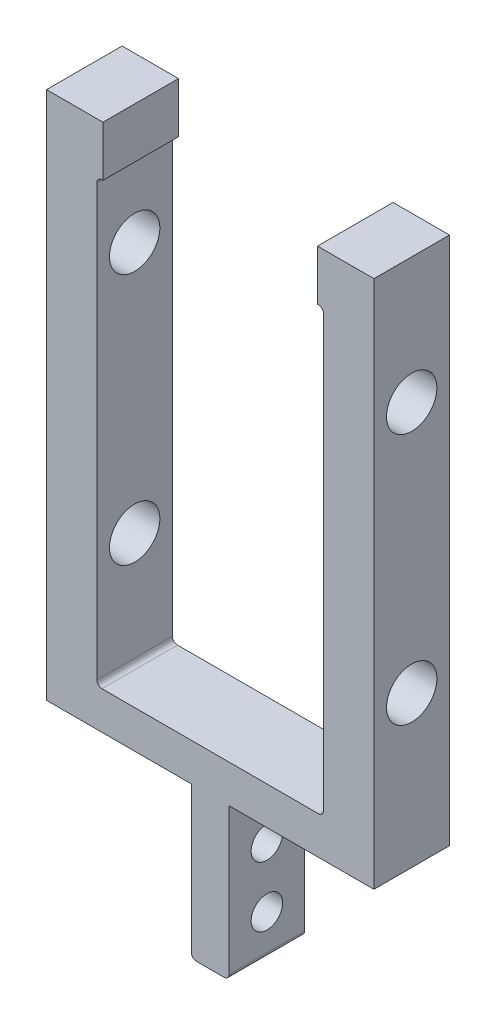
ISO-10303-21;
HEADER;
FILE_DESCRIPTION(('STEP AP214'),'2;1');
FILE_NAME('part.step','',(''),(''),'','','');
FILE_SCHEMA(('AUTOMOTIVE_DESIGN { 1 0 10303 214 1 1 1 1 }'));
ENDSEC;
DATA;
#1=APPLICATION_CONTEXT('core data for automotive mechanical design processes');
#2=APPLICATION_PROTOCOL_DEFINITION('international standard','automotive_design',2000,#1);
#3=PRODUCT_CONTEXT('',#1,'mechanical');
#4=PRODUCT('Part','Part','',(#3));
#5=PRODUCT_RELATED_PRODUCT_CATEGORY('part','',(#4));
#6=PRODUCT_DEFINITION_FORMATION('','',#4);
#7=PRODUCT_DEFINITION_CONTEXT('part definition',#1,'design');
#8=PRODUCT_DEFINITION('design','',#6,#7);
#9=PRODUCT_DEFINITION_SHAPE('','',#8);
#10=(LENGTH_UNIT() NAMED_UNIT(*) SI_UNIT(.MILLI.,.METRE.));
#11=(NAMED_UNIT(*) PLANE_ANGLE_UNIT() SI_UNIT($,.RADIAN.));
#12=(NAMED_UNIT(*) SI_UNIT($,.STERADIAN.) SOLID_ANGLE_UNIT());
#13=UNCERTAINTY_MEASURE_WITH_UNIT(LENGTH_MEASURE(1.E-05),#10,'distance_accuracy_value','');
#14=(GEOMETRIC_REPRESENTATION_CONTEXT(3) GLOBAL_UNCERTAINTY_ASSIGNED_CONTEXT((#13)) GLOBAL_UNIT_ASSIGNED_CONTEXT((#10,
#11,#12)) REPRESENTATION_CONTEXT('',''));
#15=CARTESIAN_POINT('',(0.,0.,0.));
#16=DIRECTION('',(0.,0.,1.));
#17=DIRECTION('',(1.,0.,0.));
#18=AXIS2_PLACEMENT_3D('',#15,#16,#17);
#19=CARTESIAN_POINT('',(27.051,171.45,9.525));
#20=DIRECTION('',(1.,0.,0.));
#21=DIRECTION('',(0.,0.,-1.));
#22=AXIS2_PLACEMENT_3D('',#19,#20,#21);
#23=PLANE('',#22);
#24=DIRECTION('',(0.,-1.,0.));
#25=VECTOR('',#24,1.);
#26=CARTESIAN_POINT('',(27.051,171.45,-9.525));
#27=LINE('',#26,#25);
#28=CARTESIAN_POINT('',(27.051,171.45,-9.525));
#29=VERTEX_POINT('',#28);
#30=CARTESIAN_POINT('',(27.051,158.75,-9.525));
#31=VERTEX_POINT('',#30);
#32=EDGE_CURVE('E207',#29,#31,#27,.T.);
#33=ORIENTED_EDGE('',*,*,#32,.T.);
#34=DIRECTION('',(0.,0.,-1.));
#35=VECTOR('',#34,1.);
#36=CARTESIAN_POINT('',(27.051,158.75,9.525));
#37=LINE('',#36,#35);
#38=CARTESIAN_POINT('',(27.051,158.75,9.525));
#39=VERTEX_POINT('',#38);
#40=EDGE_CURVE('E188',#39,#31,#37,.T.);
#41=ORIENTED_EDGE('',*,*,#40,.F.);
#42=DIRECTION('',(0.,-1.,0.));
#43=VECTOR('',#42,1.);
#44=CARTESIAN_POINT('',(27.051,171.45,9.525));
#45=LINE('',#44,#43);
#46=CARTESIAN_POINT('',(27.051,171.45,9.525));
#47=VERTEX_POINT('',#46);
#48=EDGE_CURVE('E194',#47,#39,#45,.T.);
#49=ORIENTED_EDGE('',*,*,#48,.F.);
#50=DIRECTION('',(0.,0.,-1.));
#51=VECTOR('',#50,1.);
#52=CARTESIAN_POINT('',(27.051,171.45,9.525));
#53=LINE('',#52,#51);
#54=EDGE_CURVE('E310',#47,#29,#53,.T.);
#55=ORIENTED_EDGE('',*,*,#54,.T.);
#56=EDGE_LOOP('',(#33,#41,#49,#55));
#57=FACE_BOUND('',#56,.T.);
#58=ADVANCED_FACE('F35',(#57),#23,.F.);
#59=CARTESIAN_POINT('',(28.575,158.75,9.525));
#60=DIRECTION('',(0.,1.,0.));
#61=DIRECTION('',(-1.,0.,0.));
#62=AXIS2_PLACEMENT_3D('',#59,#60,#61);
#63=PLANE('',#62);
#64=DIRECTION('',(1.,0.,0.));
#65=VECTOR('',#64,1.);
#66=CARTESIAN_POINT('',(28.575,158.75,-9.525));
#67=LINE('',#66,#65);
#68=CARTESIAN_POINT('',(27.305,158.75,-9.525));
#69=VERTEX_POINT('',#68);
#70=EDGE_CURVE('E312',#31,#69,#67,.T.);
#71=ORIENTED_EDGE('',*,*,#70,.T.);
#72=DIRECTION('',(0.,0.,-1.));
#73=VECTOR('',#72,1.);
#74=CARTESIAN_POINT('',(27.305,158.75,9.525));
#75=LINE('',#74,#73);
#76=CARTESIAN_POINT('',(27.305,158.75,9.525));
#77=VERTEX_POINT('',#76);
#78=EDGE_CURVE('E191',#69,#77,#75,.F.);
#79=ORIENTED_EDGE('',*,*,#78,.T.);
#80=DIRECTION('',(1.,0.,0.));
#81=VECTOR('',#80,1.);
#82=CARTESIAN_POINT('',(28.575,158.75,9.525));
#83=LINE('',#82,#81);
#84=EDGE_CURVE('E183',#39,#77,#83,.T.);
#85=ORIENTED_EDGE('',*,*,#84,.F.);
#86=ORIENTED_EDGE('',*,*,#40,.T.);
#87=EDGE_LOOP('',(#71,#79,#85,#86));
#88=FACE_BOUND('',#87,.T.);
#89=ADVANCED_FACE('F186',(#88),#63,.F.);
#90=CARTESIAN_POINT('',(28.575,158.75,9.525));
#91=DIRECTION('',(1.,0.,0.));
#92=DIRECTION('',(0.,1.,0.));
#93=AXIS2_PLACEMENT_3D('',#90,#91,#92);
#94=PLANE('',#93);
#95=CARTESIAN_POINT('',(28.575,76.2,0.));
#96=DIRECTION('',(1.,0.,0.));
#97=DIRECTION('',(0.,1.,0.));
#98=AXIS2_PLACEMENT_3D('',#95,#96,#97);
#99=CIRCLE('',#98,6.34999999999673);
#100=CARTESIAN_POINT('',(28.575,82.5499999999967,0.));
#101=VERTEX_POINT('',#100);
#102=EDGE_CURVE('E313',#101,#101,#99,.T.);
#103=ORIENTED_EDGE('',*,*,#102,.T.);
#104=EDGE_LOOP('',(#103));
#105=FACE_BOUND('',#104,.T.);
#106=CARTESIAN_POINT('',(28.575,139.7,0.));
#107=DIRECTION('',(1.,0.,0.));
#108=DIRECTION('',(0.,1.,0.));
#109=AXIS2_PLACEMENT_3D('',#106,#107,#108);
#110=CIRCLE('',#109,6.34999999999999);
#111=CARTESIAN_POINT('',(28.575,146.05,0.));
#112=VERTEX_POINT('',#111);
#113=EDGE_CURVE('E456',#112,#112,#110,.T.);
#114=ORIENTED_EDGE('',*,*,#113,.T.);
#115=EDGE_LOOP('',(#114));
#116=FACE_BOUND('',#115,.T.);
#117=DIRECTION('',(0.,-1.,0.));
#118=VECTOR('',#117,1.);
#119=CARTESIAN_POINT('',(28.575,158.75,-9.525));
#120=LINE('',#119,#118);
#121=CARTESIAN_POINT('',(28.575,157.48,-9.525));
#122=VERTEX_POINT('',#121);
#123=CARTESIAN_POINT('',(28.575,48.895,-9.525));
#124=VERTEX_POINT('',#123);
#125=EDGE_CURVE('E315',#122,#124,#120,.T.);
#126=ORIENTED_EDGE('',*,*,#125,.T.);
#127=DIRECTION('',(0.,0.,-1.));
#128=VECTOR('',#127,1.);
#129=CARTESIAN_POINT('',(28.575,48.895,9.525));
#130=LINE('',#129,#128);
#131=CARTESIAN_POINT('',(28.575,48.895,9.525));
#132=VERTEX_POINT('',#131);
#133=EDGE_CURVE('E242',#124,#132,#130,.F.);
#134=ORIENTED_EDGE('',*,*,#133,.T.);
#135=DIRECTION('',(0.,-1.,0.));
#136=VECTOR('',#135,1.);
#137=CARTESIAN_POINT('',(28.575,158.75,9.525));
#138=LINE('',#137,#136);
#139=CARTESIAN_POINT('',(28.575,157.48,9.525));
#140=VERTEX_POINT('',#139);
#141=EDGE_CURVE('E193',#140,#132,#138,.T.);
#142=ORIENTED_EDGE('',*,*,#141,.F.);
#143=DIRECTION('',(0.,0.,-1.));
#144=VECTOR('',#143,1.);
#145=CARTESIAN_POINT('',(28.575,157.48,-9.525));
#146=LINE('',#145,#144);
#147=EDGE_CURVE('E239',#140,#122,#146,.T.);
#148=ORIENTED_EDGE('',*,*,#147,.T.);
#149=EDGE_LOOP('',(#126,#134,#142,#148));
#150=FACE_BOUND('',#149,.T.);
#151=ADVANCED_FACE('F395',(#105,#116,#150),#94,.F.);
#152=CARTESIAN_POINT('',(-28.575,47.625,9.525));
#153=DIRECTION('',(0.,-1.,0.));
#154=DIRECTION('',(1.,0.,0.));
#155=AXIS2_PLACEMENT_3D('',#152,#153,#154);
#156=PLANE('',#155);
#157=DIRECTION('',(-1.,0.,0.));
#158=VECTOR('',#157,1.);
#159=CARTESIAN_POINT('',(-28.575,47.625,-9.525));
#160=LINE('',#159,#158);
#161=CARTESIAN_POINT('',(27.305,47.625,-9.525));
#162=VERTEX_POINT('',#161);
#163=CARTESIAN_POINT('',(-27.305,47.625,-9.525));
#164=VERTEX_POINT('',#163);
#165=EDGE_CURVE('E278',#162,#164,#160,.T.);
#166=ORIENTED_EDGE('',*,*,#165,.T.);
#167=DIRECTION('',(0.,0.,-1.));
#168=VECTOR('',#167,1.);
#169=CARTESIAN_POINT('',(-27.305,47.625,9.525));
#170=LINE('',#169,#168);
#171=CARTESIAN_POINT('',(-27.305,47.625,9.525));
#172=VERTEX_POINT('',#171);
#173=EDGE_CURVE('E237',#164,#172,#170,.F.);
#174=ORIENTED_EDGE('',*,*,#173,.T.);
#175=DIRECTION('',(-1.,0.,0.));
#176=VECTOR('',#175,1.);
#177=CARTESIAN_POINT('',(-28.575,47.625,9.525));
#178=LINE('',#177,#176);
#179=CARTESIAN_POINT('',(27.305,47.625,9.525));
#180=VERTEX_POINT('',#179);
#181=EDGE_CURVE('E290',#180,#172,#178,.T.);
#182=ORIENTED_EDGE('',*,*,#181,.F.);
#183=DIRECTION('',(0.,0.,-1.));
#184=VECTOR('',#183,1.);
#185=CARTESIAN_POINT('',(27.305,47.625,-9.525));
#186=LINE('',#185,#184);
#187=EDGE_CURVE('E234',#180,#162,#186,.T.);
#188=ORIENTED_EDGE('',*,*,#187,.T.);
#189=EDGE_LOOP('',(#166,#174,#182,#188));
#190=FACE_BOUND('',#189,.T.);
#191=ADVANCED_FACE('F535',(#190),#156,.F.);
#192=CARTESIAN_POINT('',(-28.575,158.75,9.525));
#193=DIRECTION('',(-1.,0.,0.));
#194=DIRECTION('',(0.,-1.,0.));
#195=AXIS2_PLACEMENT_3D('',#192,#193,#194);
#196=PLANE('',#195);
#197=CARTESIAN_POINT('',(-28.575,76.2,0.));
#198=DIRECTION('',(-1.,0.,0.));
#199=DIRECTION('',(0.,-1.,0.));
#200=AXIS2_PLACEMENT_3D('',#197,#198,#199);
#201=CIRCLE('',#200,6.34999999999673);
#202=CARTESIAN_POINT('',(-28.575,69.8500000000032,0.));
#203=VERTEX_POINT('',#202);
#204=EDGE_CURVE('E453',#203,#203,#201,.T.);
#205=ORIENTED_EDGE('',*,*,#204,.T.);
#206=EDGE_LOOP('',(#205));
#207=FACE_BOUND('',#206,.T.);
#208=CARTESIAN_POINT('',(-28.575,139.7,0.));
#209=DIRECTION('',(-1.,0.,0.));
#210=DIRECTION('',(0.,-1.,0.));
#211=AXIS2_PLACEMENT_3D('',#208,#209,#210);
#212=CIRCLE('',#211,6.34999999999999);
#213=CARTESIAN_POINT('',(-28.575,133.35,0.));
#214=VERTEX_POINT('',#213);
#215=EDGE_CURVE('E459',#214,#214,#212,.T.);
#216=ORIENTED_EDGE('',*,*,#215,.T.);
#217=EDGE_LOOP('',(#216));
#218=FACE_BOUND('',#217,.T.);
#219=DIRECTION('',(0.,1.,0.));
#220=VECTOR('',#219,1.);
#221=CARTESIAN_POINT('',(-28.575,158.75,9.525));
#222=LINE('',#221,#220);
#223=CARTESIAN_POINT('',(-28.575,48.8950000000001,9.525));
#224=VERTEX_POINT('',#223);
#225=CARTESIAN_POINT('',(-28.575,157.48,9.525));
#226=VERTEX_POINT('',#225);
#227=EDGE_CURVE('E286',#224,#226,#222,.T.);
#228=ORIENTED_EDGE('',*,*,#227,.F.);
#229=DIRECTION('',(0.,0.,-1.));
#230=VECTOR('',#229,1.);
#231=CARTESIAN_POINT('',(-28.575,48.895,-9.525));
#232=LINE('',#231,#230);
#233=CARTESIAN_POINT('',(-28.575,48.8950000000001,-9.525));
#234=VERTEX_POINT('',#233);
#235=EDGE_CURVE('E231',#224,#234,#232,.T.);
#236=ORIENTED_EDGE('',*,*,#235,.T.);
#237=DIRECTION('',(0.,1.,0.));
#238=VECTOR('',#237,1.);
#239=CARTESIAN_POINT('',(-28.575,158.75,-9.525));
#240=LINE('',#239,#238);
#241=CARTESIAN_POINT('',(-28.575,157.48,-9.525));
#242=VERTEX_POINT('',#241);
#243=EDGE_CURVE('E268',#234,#242,#240,.T.);
#244=ORIENTED_EDGE('',*,*,#243,.T.);
#245=DIRECTION('',(0.,0.,-1.));
#246=VECTOR('',#245,1.);
#247=CARTESIAN_POINT('',(-28.575,157.48,9.525));
#248=LINE('',#247,#246);
#249=EDGE_CURVE('E229',#242,#226,#248,.F.);
#250=ORIENTED_EDGE('',*,*,#249,.T.);
#251=EDGE_LOOP('',(#228,#236,#244,#250));
#252=FACE_BOUND('',#251,.T.);
#253=ADVANCED_FACE('F276',(#207,#218,#252),#196,.F.);
#254=CARTESIAN_POINT('',(-27.051,158.75,9.525));
#255=DIRECTION('',(0.,1.,0.));
#256=DIRECTION('',(-1.,0.,0.));
#257=AXIS2_PLACEMENT_3D('',#254,#255,#256);
#258=PLANE('',#257);
#259=DIRECTION('',(1.,0.,0.));
#260=VECTOR('',#259,1.);
#261=CARTESIAN_POINT('',(-27.051,158.75,9.525));
#262=LINE('',#261,#260);
#263=CARTESIAN_POINT('',(-27.305,158.75,9.525));
#264=VERTEX_POINT('',#263);
#265=CARTESIAN_POINT('',(-27.051,158.75,9.525));
#266=VERTEX_POINT('',#265);
#267=EDGE_CURVE('E283',#264,#266,#262,.T.);
#268=ORIENTED_EDGE('',*,*,#267,.F.);
#269=DIRECTION('',(0.,0.,-1.));
#270=VECTOR('',#269,1.);
#271=CARTESIAN_POINT('',(-27.305,158.75,-9.525));
#272=LINE('',#271,#270);
#273=CARTESIAN_POINT('',(-27.305,158.75,-9.525));
#274=VERTEX_POINT('',#273);
#275=EDGE_CURVE('E248',#264,#274,#272,.T.);
#276=ORIENTED_EDGE('',*,*,#275,.T.);
#277=DIRECTION('',(1.,0.,0.));
#278=VECTOR('',#277,1.);
#279=CARTESIAN_POINT('',(-27.051,158.75,-9.525));
#280=LINE('',#279,#278);
#281=CARTESIAN_POINT('',(-27.051,158.75,-9.525));
#282=VERTEX_POINT('',#281);
#283=EDGE_CURVE('E270',#274,#282,#280,.T.);
#284=ORIENTED_EDGE('',*,*,#283,.T.);
#285=DIRECTION('',(0.,0.,-1.));
#286=VECTOR('',#285,1.);
#287=CARTESIAN_POINT('',(-27.051,158.75,9.525));
#288=LINE('',#287,#286);
#289=EDGE_CURVE('E209',#266,#282,#288,.T.);
#290=ORIENTED_EDGE('',*,*,#289,.F.);
#291=EDGE_LOOP('',(#268,#276,#284,#290));
#292=FACE_BOUND('',#291,.T.);
#293=ADVANCED_FACE('F281',(#292),#258,.F.);
#294=CARTESIAN_POINT('',(-27.051,158.75,9.525));
#295=DIRECTION('',(-1.,0.,0.));
#296=DIRECTION('',(0.,0.,1.));
#297=AXIS2_PLACEMENT_3D('',#294,#295,#296);
#298=PLANE('',#297);
#299=DIRECTION('',(0.,1.,0.));
#300=VECTOR('',#299,1.);
#301=CARTESIAN_POINT('',(-27.051,158.75,-9.525));
#302=LINE('',#301,#300);
#303=CARTESIAN_POINT('',(-27.051,171.45,-9.525));
#304=VERTEX_POINT('',#303);
#305=EDGE_CURVE('E321',#282,#304,#302,.T.);
#306=ORIENTED_EDGE('',*,*,#305,.T.);
#307=DIRECTION('',(0.,0.,-1.));
#308=VECTOR('',#307,1.);
#309=CARTESIAN_POINT('',(-27.051,171.45,9.525));
#310=LINE('',#309,#308);
#311=CARTESIAN_POINT('',(-27.051,171.45,9.525));
#312=VERTEX_POINT('',#311);
#313=EDGE_CURVE('E214',#312,#304,#310,.T.);
#314=ORIENTED_EDGE('',*,*,#313,.F.);
#315=DIRECTION('',(0.,1.,0.));
#316=VECTOR('',#315,1.);
#317=CARTESIAN_POINT('',(-27.051,158.75,9.525));
#318=LINE('',#317,#316);
#319=EDGE_CURVE('E285',#266,#312,#318,.T.);
#320=ORIENTED_EDGE('',*,*,#319,.F.);
#321=ORIENTED_EDGE('',*,*,#289,.T.);
#322=EDGE_LOOP('',(#306,#314,#320,#321));
#323=FACE_BOUND('',#322,.T.);
#324=ADVANCED_FACE('F381',(#323),#298,.F.);
#325=CARTESIAN_POINT('',(-27.051,171.45,9.525));
#326=DIRECTION('',(0.,-1.,0.));
#327=DIRECTION('',(1.,0.,0.));
#328=AXIS2_PLACEMENT_3D('',#325,#326,#327);
#329=PLANE('',#328);
#330=DIRECTION('',(-1.,0.,0.));
#331=VECTOR('',#330,1.);
#332=CARTESIAN_POINT('',(-27.051,171.45,-9.525));
#333=LINE('',#332,#331);
#334=CARTESIAN_POINT('',(-41.275,171.45,-9.525));
#335=VERTEX_POINT('',#334);
#336=EDGE_CURVE('E323',#304,#335,#333,.T.);
#337=ORIENTED_EDGE('',*,*,#336,.T.);
#338=DIRECTION('',(0.,0.,-1.));
#339=VECTOR('',#338,1.);
#340=CARTESIAN_POINT('',(-41.275,171.45,9.525));
#341=LINE('',#340,#339);
#342=CARTESIAN_POINT('',(-41.275,171.45,9.525));
#343=VERTEX_POINT('',#342);
#344=EDGE_CURVE('E358',#343,#335,#341,.T.);
#345=ORIENTED_EDGE('',*,*,#344,.F.);
#346=DIRECTION('',(-1.,0.,0.));
#347=VECTOR('',#346,1.);
#348=CARTESIAN_POINT('',(-27.051,171.45,9.525));
#349=LINE('',#348,#347);
#350=EDGE_CURVE('E288',#312,#343,#349,.T.);
#351=ORIENTED_EDGE('',*,*,#350,.F.);
#352=ORIENTED_EDGE('',*,*,#313,.T.);
#353=EDGE_LOOP('',(#337,#345,#351,#352));
#354=FACE_BOUND('',#353,.T.);
#355=ADVANCED_FACE('F365',(#354),#329,.F.);
#356=CARTESIAN_POINT('',(-41.275,38.1,9.525));
#357=DIRECTION('',(1.,0.,0.));
#358=DIRECTION('',(0.,1.,0.));
#359=AXIS2_PLACEMENT_3D('',#356,#357,#358);
#360=PLANE('',#359);
#361=CARTESIAN_POINT('',(-41.275,76.2,0.));
#362=DIRECTION('',(-1.,0.,0.));
#363=DIRECTION('',(0.,-1.,0.));
#364=AXIS2_PLACEMENT_3D('',#361,#362,#363);
#365=CIRCLE('',#364,6.34999999999673);
#366=CARTESIAN_POINT('',(-41.275,69.8500000000032,0.));
#367=VERTEX_POINT('',#366);
#368=EDGE_CURVE('E470',#367,#367,#365,.T.);
#369=ORIENTED_EDGE('',*,*,#368,.F.);
#370=EDGE_LOOP('',(#369));
#371=FACE_BOUND('',#370,.T.);
#372=CARTESIAN_POINT('',(-41.275,139.7,0.));
#373=DIRECTION('',(-1.,0.,0.));
#374=DIRECTION('',(0.,-1.,0.));
#375=AXIS2_PLACEMENT_3D('',#372,#373,#374);
#376=CIRCLE('',#375,6.34999999999999);
#377=CARTESIAN_POINT('',(-41.275,133.35,0.));
#378=VERTEX_POINT('',#377);
#379=EDGE_CURVE('E463',#378,#378,#376,.T.);
#380=ORIENTED_EDGE('',*,*,#379,.F.);
#381=EDGE_LOOP('',(#380));
#382=FACE_BOUND('',#381,.T.);
#383=DIRECTION('',(0.,-1.,0.));
#384=VECTOR('',#383,1.);
#385=CARTESIAN_POINT('',(-41.275,38.1,-9.525));
#386=LINE('',#385,#384);
#387=CARTESIAN_POINT('',(-41.275,38.1,-9.525));
#388=VERTEX_POINT('',#387);
#389=EDGE_CURVE('E325',#335,#388,#386,.T.);
#390=ORIENTED_EDGE('',*,*,#389,.T.);
#391=DIRECTION('',(0.,0.,-1.));
#392=VECTOR('',#391,1.);
#393=CARTESIAN_POINT('',(-41.275,38.1,9.525));
#394=LINE('',#393,#392);
#395=CARTESIAN_POINT('',(-41.275,38.1,9.525));
#396=VERTEX_POINT('',#395);
#397=EDGE_CURVE('E355',#396,#388,#394,.T.);
#398=ORIENTED_EDGE('',*,*,#397,.F.);
#399=DIRECTION('',(0.,-1.,0.));
#400=VECTOR('',#399,1.);
#401=CARTESIAN_POINT('',(-41.275,38.1,9.525));
#402=LINE('',#401,#400);
#403=EDGE_CURVE('E295',#343,#396,#402,.T.);
#404=ORIENTED_EDGE('',*,*,#403,.F.);
#405=ORIENTED_EDGE('',*,*,#344,.T.);
#406=EDGE_LOOP('',(#390,#398,#404,#405));
#407=FACE_BOUND('',#406,.T.);
#408=ADVANCED_FACE('F373',(#371,#382,#407),#360,.F.);
#409=CARTESIAN_POINT('',(-4.7625,38.1,9.525));
#410=DIRECTION('',(0.,1.,0.));
#411=DIRECTION('',(-1.,0.,0.));
#412=AXIS2_PLACEMENT_3D('',#409,#410,#411);
#413=PLANE('',#412);
#414=DIRECTION('',(1.,0.,0.));
#415=VECTOR('',#414,1.);
#416=CARTESIAN_POINT('',(-4.7625,38.1,-9.525));
#417=LINE('',#416,#415);
#418=CARTESIAN_POINT('',(-4.7625,38.1,-9.525));
#419=VERTEX_POINT('',#418);
#420=EDGE_CURVE('E327',#388,#419,#417,.T.);
#421=ORIENTED_EDGE('',*,*,#420,.T.);
#422=DIRECTION('',(0.,0.,-1.));
#423=VECTOR('',#422,1.);
#424=CARTESIAN_POINT('',(-4.7625,38.1,9.525));
#425=LINE('',#424,#423);
#426=CARTESIAN_POINT('',(-4.7625,38.1,9.525));
#427=VERTEX_POINT('',#426);
#428=EDGE_CURVE('E352',#427,#419,#425,.T.);
#429=ORIENTED_EDGE('',*,*,#428,.F.);
#430=DIRECTION('',(1.,0.,0.));
#431=VECTOR('',#430,1.);
#432=CARTESIAN_POINT('',(-4.7625,38.1,9.525));
#433=LINE('',#432,#431);
#434=EDGE_CURVE('E297',#396,#427,#433,.T.);
#435=ORIENTED_EDGE('',*,*,#434,.F.);
#436=ORIENTED_EDGE('',*,*,#397,.T.);
#437=EDGE_LOOP('',(#421,#429,#435,#436));
#438=FACE_BOUND('',#437,.T.);
#439=ADVANCED_FACE('F377',(#438),#413,.F.);
#440=CARTESIAN_POINT('',(-4.7625,0.,9.525));
#441=DIRECTION('',(1.,0.,0.));
#442=DIRECTION('',(0.,0.,-1.));
#443=AXIS2_PLACEMENT_3D('',#440,#441,#442);
#444=PLANE('',#443);
#445=CARTESIAN_POINT('',(-4.7625,25.4,0.));
#446=DIRECTION('',(1.,0.,0.));
#447=DIRECTION('',(0.,0.,-1.));
#448=AXIS2_PLACEMENT_3D('',#445,#446,#447);
#449=CIRCLE('',#448,3.97256);
#450=CARTESIAN_POINT('',(-4.7625,25.4,-3.97256));
#451=VERTEX_POINT('',#450);
#452=EDGE_CURVE('E480',#451,#451,#449,.T.);
#453=ORIENTED_EDGE('',*,*,#452,.T.);
#454=EDGE_LOOP('',(#453));
#455=FACE_BOUND('',#454,.T.);
#456=CARTESIAN_POINT('',(-4.7625,10.16,0.));
#457=DIRECTION('',(1.,0.,0.));
#458=DIRECTION('',(0.,0.,-1.));
#459=AXIS2_PLACEMENT_3D('',#456,#457,#458);
#460=CIRCLE('',#459,3.97256);
#461=CARTESIAN_POINT('',(-4.7625,10.16,-3.97256));
#462=VERTEX_POINT('',#461);
#463=EDGE_CURVE('E467',#462,#462,#460,.T.);
#464=ORIENTED_EDGE('',*,*,#463,.T.);
#465=EDGE_LOOP('',(#464));
#466=FACE_BOUND('',#465,.T.);
#467=DIRECTION('',(0.,-1.,0.));
#468=VECTOR('',#467,1.);
#469=CARTESIAN_POINT('',(-4.7625,0.,-9.525));
#470=LINE('',#469,#468);
#471=CARTESIAN_POINT('',(-4.7625,1.27,-9.525));
#472=VERTEX_POINT('',#471);
#473=EDGE_CURVE('E329',#419,#472,#470,.T.);
#474=ORIENTED_EDGE('',*,*,#473,.T.);
#475=DIRECTION('',(0.,0.,-1.));
#476=VECTOR('',#475,1.);
#477=CARTESIAN_POINT('',(-4.7625,1.27,9.525));
#478=LINE('',#477,#476);
#479=CARTESIAN_POINT('',(-4.7625,1.27,9.525));
#480=VERTEX_POINT('',#479);
#481=EDGE_CURVE('E224',#472,#480,#478,.F.);
#482=ORIENTED_EDGE('',*,*,#481,.T.);
#483=DIRECTION('',(0.,-1.,0.));
#484=VECTOR('',#483,1.);
#485=CARTESIAN_POINT('',(-4.7625,0.,9.525));
#486=LINE('',#485,#484);
#487=EDGE_CURVE('E299',#427,#480,#486,.T.);
#488=ORIENTED_EDGE('',*,*,#487,.F.);
#489=ORIENTED_EDGE('',*,*,#428,.T.);
#490=EDGE_LOOP('',(#474,#482,#488,#489));
#491=FACE_BOUND('',#490,.T.);
#492=ADVANCED_FACE('F501',(#455,#466,#491),#444,.F.);
#493=CARTESIAN_POINT('',(4.7625,0.,9.525));
#494=DIRECTION('',(0.,1.,0.));
#495=DIRECTION('',(-1.,0.,0.));
#496=AXIS2_PLACEMENT_3D('',#493,#494,#495);
#497=PLANE('',#496);
#498=DIRECTION('',(1.,0.,0.));
#499=VECTOR('',#498,1.);
#500=CARTESIAN_POINT('',(4.7625,0.,9.525));
#501=LINE('',#500,#499);
#502=CARTESIAN_POINT('',(-3.49249999999999,0.,9.525));
#503=VERTEX_POINT('',#502);
#504=CARTESIAN_POINT('',(3.4925,0.,9.525));
#505=VERTEX_POINT('',#504);
#506=EDGE_CURVE('E301',#503,#505,#501,.T.);
#507=ORIENTED_EDGE('',*,*,#506,.F.);
#508=DIRECTION('',(0.,0.,-1.));
#509=VECTOR('',#508,1.);
#510=CARTESIAN_POINT('',(-3.4925,0.,9.525));
#511=LINE('',#510,#509);
#512=CARTESIAN_POINT('',(-3.49249999999999,0.,-9.525));
#513=VERTEX_POINT('',#512);
#514=EDGE_CURVE('E211',#503,#513,#511,.T.);
#515=ORIENTED_EDGE('',*,*,#514,.T.);
#516=DIRECTION('',(1.,0.,0.));
#517=VECTOR('',#516,1.);
#518=CARTESIAN_POINT('',(4.7625,0.,-9.525));
#519=LINE('',#518,#517);
#520=CARTESIAN_POINT('',(3.4925,0.,-9.525));
#521=VERTEX_POINT('',#520);
#522=EDGE_CURVE('E332',#513,#521,#519,.T.);
#523=ORIENTED_EDGE('',*,*,#522,.T.);
#524=DIRECTION('',(0.,0.,-1.));
#525=VECTOR('',#524,1.);
#526=CARTESIAN_POINT('',(3.4925,0.,9.525));
#527=LINE('',#526,#525);
#528=EDGE_CURVE('E208',#521,#505,#527,.F.);
#529=ORIENTED_EDGE('',*,*,#528,.T.);
#530=EDGE_LOOP('',(#507,#515,#523,#529));
#531=FACE_BOUND('',#530,.T.);
#532=ADVANCED_FACE('F492',(#531),#497,.F.);
#533=CARTESIAN_POINT('',(4.7625,0.,9.525));
#534=DIRECTION('',(-1.,0.,0.));
#535=DIRECTION('',(0.,-1.,0.));
#536=AXIS2_PLACEMENT_3D('',#533,#534,#535);
#537=PLANE('',#536);
#538=CARTESIAN_POINT('',(4.7625,25.4,0.));
#539=DIRECTION('',(1.,0.,0.));
#540=DIRECTION('',(0.,0.,-1.));
#541=AXIS2_PLACEMENT_3D('',#538,#539,#540);
#542=CIRCLE('',#541,3.97256);
#543=CARTESIAN_POINT('',(4.7625,25.4,-3.97256));
#544=VERTEX_POINT('',#543);
#545=EDGE_CURVE('E483',#544,#544,#542,.T.);
#546=ORIENTED_EDGE('',*,*,#545,.F.);
#547=EDGE_LOOP('',(#546));
#548=FACE_BOUND('',#547,.T.);
#549=CARTESIAN_POINT('',(4.7625,10.16,0.));
#550=DIRECTION('',(1.,0.,0.));
#551=DIRECTION('',(0.,0.,-1.));
#552=AXIS2_PLACEMENT_3D('',#549,#550,#551);
#553=CIRCLE('',#552,3.97256);
#554=CARTESIAN_POINT('',(4.7625,10.16,-3.97256));
#555=VERTEX_POINT('',#554);
#556=EDGE_CURVE('E477',#555,#555,#553,.T.);
#557=ORIENTED_EDGE('',*,*,#556,.F.);
#558=EDGE_LOOP('',(#557));
#559=FACE_BOUND('',#558,.T.);
#560=DIRECTION('',(0.,1.,0.));
#561=VECTOR('',#560,1.);
#562=CARTESIAN_POINT('',(4.7625,0.,9.525));
#563=LINE('',#562,#561);
#564=CARTESIAN_POINT('',(4.7625,1.27,9.525));
#565=VERTEX_POINT('',#564);
#566=CARTESIAN_POINT('',(4.76249999999999,38.1,9.525));
#567=VERTEX_POINT('',#566);
#568=EDGE_CURVE('E303',#565,#567,#563,.T.);
#569=ORIENTED_EDGE('',*,*,#568,.F.);
#570=DIRECTION('',(0.,0.,-1.));
#571=VECTOR('',#570,1.);
#572=CARTESIAN_POINT('',(4.7625,1.27,9.525));
#573=LINE('',#572,#571);
#574=CARTESIAN_POINT('',(4.7625,1.27,-9.525));
#575=VERTEX_POINT('',#574);
#576=EDGE_CURVE('E245',#565,#575,#573,.T.);
#577=ORIENTED_EDGE('',*,*,#576,.T.);
#578=DIRECTION('',(0.,1.,0.));
#579=VECTOR('',#578,1.);
#580=CARTESIAN_POINT('',(4.7625,0.,-9.525));
#581=LINE('',#580,#579);
#582=CARTESIAN_POINT('',(4.76249999999999,38.1,-9.525));
#583=VERTEX_POINT('',#582);
#584=EDGE_CURVE('E335',#575,#583,#581,.T.);
#585=ORIENTED_EDGE('',*,*,#584,.T.);
#586=DIRECTION('',(0.,0.,-1.));
#587=VECTOR('',#586,1.);
#588=CARTESIAN_POINT('',(4.76249999999999,38.1,9.525));
#589=LINE('',#588,#587);
#590=EDGE_CURVE('E349',#567,#583,#589,.T.);
#591=ORIENTED_EDGE('',*,*,#590,.F.);
#592=EDGE_LOOP('',(#569,#577,#585,#591));
#593=FACE_BOUND('',#592,.T.);
#594=ADVANCED_FACE('F426',(#548,#559,#593),#537,.F.);
#595=CARTESIAN_POINT('',(4.76249999999999,38.1,9.525));
#596=DIRECTION('',(0.,1.,0.));
#597=DIRECTION('',(0.,0.,1.));
#598=AXIS2_PLACEMENT_3D('',#595,#596,#597);
#599=PLANE('',#598);
#600=DIRECTION('',(1.,0.,0.));
#601=VECTOR('',#600,1.);
#602=CARTESIAN_POINT('',(4.76249999999999,38.1,-9.525));
#603=LINE('',#602,#601);
#604=CARTESIAN_POINT('',(41.275,38.1,-9.525));
#605=VERTEX_POINT('',#604);
#606=EDGE_CURVE('E337',#583,#605,#603,.T.);
#607=ORIENTED_EDGE('',*,*,#606,.T.);
#608=DIRECTION('',(0.,0.,-1.));
#609=VECTOR('',#608,1.);
#610=CARTESIAN_POINT('',(41.275,38.1,9.525));
#611=LINE('',#610,#609);
#612=CARTESIAN_POINT('',(41.275,38.1,9.525));
#613=VERTEX_POINT('',#612);
#614=EDGE_CURVE('E346',#613,#605,#611,.T.);
#615=ORIENTED_EDGE('',*,*,#614,.F.);
#616=DIRECTION('',(1.,0.,0.));
#617=VECTOR('',#616,1.);
#618=CARTESIAN_POINT('',(4.76249999999999,38.1,9.525));
#619=LINE('',#618,#617);
#620=EDGE_CURVE('E305',#567,#613,#619,.T.);
#621=ORIENTED_EDGE('',*,*,#620,.F.);
#622=ORIENTED_EDGE('',*,*,#590,.T.);
#623=EDGE_LOOP('',(#607,#615,#621,#622));
#624=FACE_BOUND('',#623,.T.);
#625=ADVANCED_FACE('F433',(#624),#599,.F.);
#626=CARTESIAN_POINT('',(41.275,38.1,9.525));
#627=DIRECTION('',(-1.,0.,0.));
#628=DIRECTION('',(0.,-1.,0.));
#629=AXIS2_PLACEMENT_3D('',#626,#627,#628);
#630=PLANE('',#629);
#631=CARTESIAN_POINT('',(41.275,76.2,0.));
#632=DIRECTION('',(-1.,0.,0.));
#633=DIRECTION('',(0.,-1.,0.));
#634=AXIS2_PLACEMENT_3D('',#631,#632,#633);
#635=CIRCLE('',#634,6.34999999999673);
#636=CARTESIAN_POINT('',(41.275,69.8500000000033,0.));
#637=VERTEX_POINT('',#636);
#638=EDGE_CURVE('E462',#637,#637,#635,.T.);
#639=ORIENTED_EDGE('',*,*,#638,.T.);
#640=EDGE_LOOP('',(#639));
#641=FACE_BOUND('',#640,.T.);
#642=CARTESIAN_POINT('',(41.275,139.7,0.));
#643=DIRECTION('',(-1.,0.,0.));
#644=DIRECTION('',(0.,-1.,0.));
#645=AXIS2_PLACEMENT_3D('',#642,#643,#644);
#646=CIRCLE('',#645,6.34999999999999);
#647=CARTESIAN_POINT('',(41.275,133.35,0.));
#648=VERTEX_POINT('',#647);
#649=EDGE_CURVE('E466',#648,#648,#646,.T.);
#650=ORIENTED_EDGE('',*,*,#649,.T.);
#651=EDGE_LOOP('',(#650));
#652=FACE_BOUND('',#651,.T.);
#653=DIRECTION('',(0.,1.,0.));
#654=VECTOR('',#653,1.);
#655=CARTESIAN_POINT('',(41.275,38.1,-9.525));
#656=LINE('',#655,#654);
#657=CARTESIAN_POINT('',(41.275,171.45,-9.525));
#658=VERTEX_POINT('',#657);
#659=EDGE_CURVE('E339',#605,#658,#656,.T.);
#660=ORIENTED_EDGE('',*,*,#659,.T.);
#661=DIRECTION('',(0.,0.,-1.));
#662=VECTOR('',#661,1.);
#663=CARTESIAN_POINT('',(41.275,171.45,9.525));
#664=LINE('',#663,#662);
#665=CARTESIAN_POINT('',(41.275,171.45,9.525));
#666=VERTEX_POINT('',#665);
#667=EDGE_CURVE('E343',#666,#658,#664,.T.);
#668=ORIENTED_EDGE('',*,*,#667,.F.);
#669=DIRECTION('',(0.,1.,0.));
#670=VECTOR('',#669,1.);
#671=CARTESIAN_POINT('',(41.275,38.1,9.525));
#672=LINE('',#671,#670);
#673=EDGE_CURVE('E307',#613,#666,#672,.T.);
#674=ORIENTED_EDGE('',*,*,#673,.F.);
#675=ORIENTED_EDGE('',*,*,#614,.T.);
#676=EDGE_LOOP('',(#660,#668,#674,#675));
#677=FACE_BOUND('',#676,.T.);
#678=ADVANCED_FACE('F437',(#641,#652,#677),#630,.F.);
#679=CARTESIAN_POINT('',(41.275,171.45,9.525));
#680=DIRECTION('',(0.,-1.,0.));
#681=DIRECTION('',(1.,0.,0.));
#682=AXIS2_PLACEMENT_3D('',#679,#680,#681);
#683=PLANE('',#682);
#684=DIRECTION('',(-1.,0.,0.));
#685=VECTOR('',#684,1.);
#686=CARTESIAN_POINT('',(41.275,171.45,-9.525));
#687=LINE('',#686,#685);
#688=EDGE_CURVE('E204',#658,#29,#687,.T.);
#689=ORIENTED_EDGE('',*,*,#688,.T.);
#690=ORIENTED_EDGE('',*,*,#54,.F.);
#691=DIRECTION('',(-1.,0.,0.));
#692=VECTOR('',#691,1.);
#693=CARTESIAN_POINT('',(41.275,171.45,9.525));
#694=LINE('',#693,#692);
#695=EDGE_CURVE('E200',#666,#47,#694,.T.);
#696=ORIENTED_EDGE('',*,*,#695,.F.);
#697=ORIENTED_EDGE('',*,*,#667,.T.);
#698=EDGE_LOOP('',(#689,#690,#696,#697));
#699=FACE_BOUND('',#698,.T.);
#700=ADVANCED_FACE('F440',(#699),#683,.F.);
#701=CARTESIAN_POINT('',(0.,0.,9.525));
#702=DIRECTION('',(0.,0.,-1.));
#703=DIRECTION('',(-1.,0.,0.));
#704=AXIS2_PLACEMENT_3D('',#701,#702,#703);
#705=PLANE('',#704);
#706=ORIENTED_EDGE('',*,*,#487,.T.);
#707=CARTESIAN_POINT('',(-3.4925,1.27,9.525));
#708=DIRECTION('',(0.,0.,-1.));
#709=DIRECTION('',(-1.,0.,0.));
#710=AXIS2_PLACEMENT_3D('',#707,#708,#709);
#711=CIRCLE('',#710,1.27);
#712=EDGE_CURVE('E227',#480,#503,#711,.F.);
#713=ORIENTED_EDGE('',*,*,#712,.T.);
#714=ORIENTED_EDGE('',*,*,#506,.T.);
#715=CARTESIAN_POINT('',(3.4925,1.27,9.525));
#716=DIRECTION('',(0.,0.,-1.));
#717=DIRECTION('',(-1.,0.,0.));
#718=AXIS2_PLACEMENT_3D('',#715,#716,#717);
#719=CIRCLE('',#718,1.27);
#720=EDGE_CURVE('E50',#505,#565,#719,.F.);
#721=ORIENTED_EDGE('',*,*,#720,.T.);
#722=ORIENTED_EDGE('',*,*,#568,.T.);
#723=ORIENTED_EDGE('',*,*,#620,.T.);
#724=ORIENTED_EDGE('',*,*,#673,.T.);
#725=ORIENTED_EDGE('',*,*,#695,.T.);
#726=ORIENTED_EDGE('',*,*,#48,.T.);
#727=ORIENTED_EDGE('',*,*,#84,.T.);
#728=CARTESIAN_POINT('',(27.305,157.48,9.525));
#729=DIRECTION('',(0.,0.,-1.));
#730=DIRECTION('',(-1.,0.,0.));
#731=AXIS2_PLACEMENT_3D('',#728,#729,#730);
#732=CIRCLE('',#731,1.27);
#733=EDGE_CURVE('E261',#77,#140,#732,.T.);
#734=ORIENTED_EDGE('',*,*,#733,.T.);
#735=ORIENTED_EDGE('',*,*,#141,.T.);
#736=CARTESIAN_POINT('',(27.305,48.895,9.525));
#737=DIRECTION('',(0.,0.,-1.));
#738=DIRECTION('',(-1.,0.,0.));
#739=AXIS2_PLACEMENT_3D('',#736,#737,#738);
#740=CIRCLE('',#739,1.27);
#741=EDGE_CURVE('E257',#132,#180,#740,.T.);
#742=ORIENTED_EDGE('',*,*,#741,.T.);
#743=ORIENTED_EDGE('',*,*,#181,.T.);
#744=CARTESIAN_POINT('',(-27.305,48.895,9.525));
#745=DIRECTION('',(0.,0.,-1.));
#746=DIRECTION('',(-1.,0.,0.));
#747=AXIS2_PLACEMENT_3D('',#744,#745,#746);
#748=CIRCLE('',#747,1.27);
#749=EDGE_CURVE('E253',#172,#224,#748,.T.);
#750=ORIENTED_EDGE('',*,*,#749,.T.);
#751=ORIENTED_EDGE('',*,*,#227,.T.);
#752=CARTESIAN_POINT('',(-27.305,157.48,9.525));
#753=DIRECTION('',(0.,0.,-1.));
#754=DIRECTION('',(-1.,0.,0.));
#755=AXIS2_PLACEMENT_3D('',#752,#753,#754);
#756=CIRCLE('',#755,1.27);
#757=EDGE_CURVE('E11',#226,#264,#756,.T.);
#758=ORIENTED_EDGE('',*,*,#757,.T.);
#759=ORIENTED_EDGE('',*,*,#267,.T.);
#760=ORIENTED_EDGE('',*,*,#319,.T.);
#761=ORIENTED_EDGE('',*,*,#350,.T.);
#762=ORIENTED_EDGE('',*,*,#403,.T.);
#763=ORIENTED_EDGE('',*,*,#434,.T.);
#764=EDGE_LOOP('',(#706,#713,#714,#721,#722,#723,#724,#725,#726,#727,#734,#735,#742,#743,#750,
#751,#758,#759,#760,#761,#762,#763));
#765=FACE_BOUND('',#764,.T.);
#766=ADVANCED_FACE('F198',(#765),#705,.F.);
#767=CARTESIAN_POINT('',(0.,0.,-9.525));
#768=DIRECTION('',(0.,0.,-1.));
#769=DIRECTION('',(-1.,0.,0.));
#770=AXIS2_PLACEMENT_3D('',#767,#768,#769);
#771=PLANE('',#770);
#772=ORIENTED_EDGE('',*,*,#522,.F.);
#773=CARTESIAN_POINT('',(-3.4925,1.27,-9.525));
#774=DIRECTION('',(0.,0.,-1.));
#775=DIRECTION('',(-1.,0.,0.));
#776=AXIS2_PLACEMENT_3D('',#773,#774,#775);
#777=CIRCLE('',#776,1.27);
#778=EDGE_CURVE('E222',#513,#472,#777,.T.);
#779=ORIENTED_EDGE('',*,*,#778,.T.);
#780=ORIENTED_EDGE('',*,*,#473,.F.);
#781=ORIENTED_EDGE('',*,*,#420,.F.);
#782=ORIENTED_EDGE('',*,*,#389,.F.);
#783=ORIENTED_EDGE('',*,*,#336,.F.);
#784=ORIENTED_EDGE('',*,*,#305,.F.);
#785=ORIENTED_EDGE('',*,*,#283,.F.);
#786=CARTESIAN_POINT('',(-27.305,157.48,-9.525));
#787=DIRECTION('',(0.,0.,-1.));
#788=DIRECTION('',(-1.,0.,0.));
#789=AXIS2_PLACEMENT_3D('',#786,#787,#788);
#790=CIRCLE('',#789,1.27);
#791=EDGE_CURVE('E43',#274,#242,#790,.F.);
#792=ORIENTED_EDGE('',*,*,#791,.T.);
#793=ORIENTED_EDGE('',*,*,#243,.F.);
#794=CARTESIAN_POINT('',(-27.305,48.895,-9.525));
#795=DIRECTION('',(0.,0.,-1.));
#796=DIRECTION('',(-1.,0.,0.));
#797=AXIS2_PLACEMENT_3D('',#794,#795,#796);
#798=CIRCLE('',#797,1.27);
#799=EDGE_CURVE('E251',#234,#164,#798,.F.);
#800=ORIENTED_EDGE('',*,*,#799,.T.);
#801=ORIENTED_EDGE('',*,*,#165,.F.);
#802=CARTESIAN_POINT('',(27.305,48.895,-9.525));
#803=DIRECTION('',(0.,0.,-1.));
#804=DIRECTION('',(-1.,0.,0.));
#805=AXIS2_PLACEMENT_3D('',#802,#803,#804);
#806=CIRCLE('',#805,1.27);
#807=EDGE_CURVE('E255',#162,#124,#806,.F.);
#808=ORIENTED_EDGE('',*,*,#807,.T.);
#809=ORIENTED_EDGE('',*,*,#125,.F.);
#810=CARTESIAN_POINT('',(27.305,157.48,-9.525));
#811=DIRECTION('',(0.,0.,-1.));
#812=DIRECTION('',(-1.,0.,0.));
#813=AXIS2_PLACEMENT_3D('',#810,#811,#812);
#814=CIRCLE('',#813,1.27);
#815=EDGE_CURVE('E259',#122,#69,#814,.F.);
#816=ORIENTED_EDGE('',*,*,#815,.T.);
#817=ORIENTED_EDGE('',*,*,#70,.F.);
#818=ORIENTED_EDGE('',*,*,#32,.F.);
#819=ORIENTED_EDGE('',*,*,#688,.F.);
#820=ORIENTED_EDGE('',*,*,#659,.F.);
#821=ORIENTED_EDGE('',*,*,#606,.F.);
#822=ORIENTED_EDGE('',*,*,#584,.F.);
#823=CARTESIAN_POINT('',(3.4925,1.27,-9.525));
#824=DIRECTION('',(0.,0.,-1.));
#825=DIRECTION('',(-1.,0.,0.));
#826=AXIS2_PLACEMENT_3D('',#823,#824,#825);
#827=CIRCLE('',#826,1.27);
#828=EDGE_CURVE('E220',#575,#521,#827,.T.);
#829=ORIENTED_EDGE('',*,*,#828,.T.);
#830=EDGE_LOOP('',(#772,#779,#780,#781,#782,#783,#784,#785,#792,#793,#800,#801,#808,#809,#816,
#817,#818,#819,#820,#821,#822,#829));
#831=FACE_BOUND('',#830,.T.);
#832=ADVANCED_FACE('F267',(#831),#771,.T.);
#833=CARTESIAN_POINT('',(41.275,139.7,0.));
#834=DIRECTION('',(-1.,0.,0.));
#835=DIRECTION('',(0.,-1.,0.));
#836=AXIS2_PLACEMENT_3D('',#833,#834,#835);
#837=CYLINDRICAL_SURFACE('',#836,6.34999999999999);
#838=ORIENTED_EDGE('',*,*,#649,.F.);
#839=EDGE_LOOP('',(#838));
#840=FACE_BOUND('',#839,.T.);
#841=ORIENTED_EDGE('',*,*,#113,.F.);
#842=EDGE_LOOP('',(#841));
#843=FACE_BOUND('',#842,.T.);
#844=ADVANCED_FACE('F531',(#840,#843),#837,.F.);
#845=CARTESIAN_POINT('',(41.275,76.2,0.));
#846=DIRECTION('',(-1.,0.,0.));
#847=DIRECTION('',(0.,-1.,0.));
#848=AXIS2_PLACEMENT_3D('',#845,#846,#847);
#849=CYLINDRICAL_SURFACE('',#848,6.34999999999673);
#850=ORIENTED_EDGE('',*,*,#638,.F.);
#851=EDGE_LOOP('',(#850));
#852=FACE_BOUND('',#851,.T.);
#853=ORIENTED_EDGE('',*,*,#102,.F.);
#854=EDGE_LOOP('',(#853));
#855=FACE_BOUND('',#854,.T.);
#856=ADVANCED_FACE('F529',(#852,#855),#849,.F.);
#857=ORIENTED_EDGE('',*,*,#379,.T.);
#858=EDGE_LOOP('',(#857));
#859=FACE_BOUND('',#858,.T.);
#860=ORIENTED_EDGE('',*,*,#215,.F.);
#861=EDGE_LOOP('',(#860));
#862=FACE_BOUND('',#861,.T.);
#863=ADVANCED_FACE('F526',(#859,#862),#837,.F.);
#864=ORIENTED_EDGE('',*,*,#368,.T.);
#865=EDGE_LOOP('',(#864));
#866=FACE_BOUND('',#865,.T.);
#867=ORIENTED_EDGE('',*,*,#204,.F.);
#868=EDGE_LOOP('',(#867));
#869=FACE_BOUND('',#868,.T.);
#870=ADVANCED_FACE('F403',(#866,#869),#849,.F.);
#871=CARTESIAN_POINT('',(-3.4925,1.27,9.525));
#872=DIRECTION('',(0.,0.,-1.));
#873=DIRECTION('',(-1.,0.,0.));
#874=AXIS2_PLACEMENT_3D('',#871,#872,#873);
#875=CYLINDRICAL_SURFACE('',#874,1.27);
#876=ORIENTED_EDGE('',*,*,#712,.F.);
#877=ORIENTED_EDGE('',*,*,#481,.F.);
#878=ORIENTED_EDGE('',*,*,#778,.F.);
#879=ORIENTED_EDGE('',*,*,#514,.F.);
#880=EDGE_LOOP('',(#876,#877,#878,#879));
#881=FACE_BOUND('',#880,.T.);
#882=ADVANCED_FACE('F399',(#881),#875,.T.);
#883=CARTESIAN_POINT('',(-27.305,48.895,9.525));
#884=DIRECTION('',(0.,0.,1.));
#885=DIRECTION('',(1.,0.,0.));
#886=AXIS2_PLACEMENT_3D('',#883,#884,#885);
#887=CYLINDRICAL_SURFACE('',#886,1.27);
#888=ORIENTED_EDGE('',*,*,#749,.F.);
#889=ORIENTED_EDGE('',*,*,#173,.F.);
#890=ORIENTED_EDGE('',*,*,#799,.F.);
#891=ORIENTED_EDGE('',*,*,#235,.F.);
#892=EDGE_LOOP('',(#888,#889,#890,#891));
#893=FACE_BOUND('',#892,.T.);
#894=ADVANCED_FACE('F402',(#893),#887,.F.);
#895=CARTESIAN_POINT('',(27.305,48.895,9.525));
#896=DIRECTION('',(0.,0.,1.));
#897=DIRECTION('',(1.,0.,0.));
#898=AXIS2_PLACEMENT_3D('',#895,#896,#897);
#899=CYLINDRICAL_SURFACE('',#898,1.27);
#900=ORIENTED_EDGE('',*,*,#741,.F.);
#901=ORIENTED_EDGE('',*,*,#133,.F.);
#902=ORIENTED_EDGE('',*,*,#807,.F.);
#903=ORIENTED_EDGE('',*,*,#187,.F.);
#904=EDGE_LOOP('',(#900,#901,#902,#903));
#905=FACE_BOUND('',#904,.T.);
#906=ADVANCED_FACE('F407',(#905),#899,.F.);
#907=CARTESIAN_POINT('',(27.305,157.48,9.525));
#908=DIRECTION('',(0.,0.,1.));
#909=DIRECTION('',(1.,0.,0.));
#910=AXIS2_PLACEMENT_3D('',#907,#908,#909);
#911=CYLINDRICAL_SURFACE('',#910,1.27);
#912=ORIENTED_EDGE('',*,*,#733,.F.);
#913=ORIENTED_EDGE('',*,*,#78,.F.);
#914=ORIENTED_EDGE('',*,*,#815,.F.);
#915=ORIENTED_EDGE('',*,*,#147,.F.);
#916=EDGE_LOOP('',(#912,#913,#914,#915));
#917=FACE_BOUND('',#916,.T.);
#918=ADVANCED_FACE('F411',(#917),#911,.F.);
#919=CARTESIAN_POINT('',(3.4925,1.27,9.525));
#920=DIRECTION('',(0.,0.,-1.));
#921=DIRECTION('',(-1.,0.,0.));
#922=AXIS2_PLACEMENT_3D('',#919,#920,#921);
#923=CYLINDRICAL_SURFACE('',#922,1.27);
#924=ORIENTED_EDGE('',*,*,#720,.F.);
#925=ORIENTED_EDGE('',*,*,#528,.F.);
#926=ORIENTED_EDGE('',*,*,#828,.F.);
#927=ORIENTED_EDGE('',*,*,#576,.F.);
#928=EDGE_LOOP('',(#924,#925,#926,#927));
#929=FACE_BOUND('',#928,.T.);
#930=ADVANCED_FACE('F414',(#929),#923,.T.);
#931=CARTESIAN_POINT('',(-27.305,157.48,9.525));
#932=DIRECTION('',(0.,0.,1.));
#933=DIRECTION('',(1.,0.,0.));
#934=AXIS2_PLACEMENT_3D('',#931,#932,#933);
#935=CYLINDRICAL_SURFACE('',#934,1.27);
#936=ORIENTED_EDGE('',*,*,#757,.F.);
#937=ORIENTED_EDGE('',*,*,#249,.F.);
#938=ORIENTED_EDGE('',*,*,#791,.F.);
#939=ORIENTED_EDGE('',*,*,#275,.F.);
#940=EDGE_LOOP('',(#936,#937,#938,#939));
#941=FACE_BOUND('',#940,.T.);
#942=ADVANCED_FACE('F37',(#941),#935,.F.);
#943=CARTESIAN_POINT('',(4.7625,10.16,0.));
#944=DIRECTION('',(1.,0.,0.));
#945=DIRECTION('',(0.,0.,-1.));
#946=AXIS2_PLACEMENT_3D('',#943,#944,#945);
#947=CYLINDRICAL_SURFACE('',#946,3.97256);
#948=ORIENTED_EDGE('',*,*,#556,.T.);
#949=EDGE_LOOP('',(#948));
#950=FACE_BOUND('',#949,.T.);
#951=ORIENTED_EDGE('',*,*,#463,.F.);
#952=EDGE_LOOP('',(#951));
#953=FACE_BOUND('',#952,.T.);
#954=ADVANCED_FACE('F421',(#950,#953),#947,.F.);
#955=CARTESIAN_POINT('',(4.7625,25.4,0.));
#956=DIRECTION('',(1.,0.,0.));
#957=DIRECTION('',(0.,0.,-1.));
#958=AXIS2_PLACEMENT_3D('',#955,#956,#957);
#959=CYLINDRICAL_SURFACE('',#958,3.97256);
#960=ORIENTED_EDGE('',*,*,#545,.T.);
#961=EDGE_LOOP('',(#960));
#962=FACE_BOUND('',#961,.T.);
#963=ORIENTED_EDGE('',*,*,#452,.F.);
#964=EDGE_LOOP('',(#963));
#965=FACE_BOUND('',#964,.T.);
#966=ADVANCED_FACE('F487',(#962,#965),#959,.F.);
#967=CLOSED_SHELL('',(#58,#89,#151,#191,#253,#293,#324,#355,#408,#439,#492,#532,#594,#625,#678,
#700,#766,#832,#844,#856,#863,#870,#882,#894,#906,#918,#930,#942,#954,#966));
#968=MANIFOLD_SOLID_BREP('B2',#967);
#969=ADVANCED_BREP_SHAPE_REPRESENTATION('',(#18,#968),#14);
#970=SHAPE_DEFINITION_REPRESENTATION(#9,#969);
ENDSEC;
END-ISO-10303-21;
